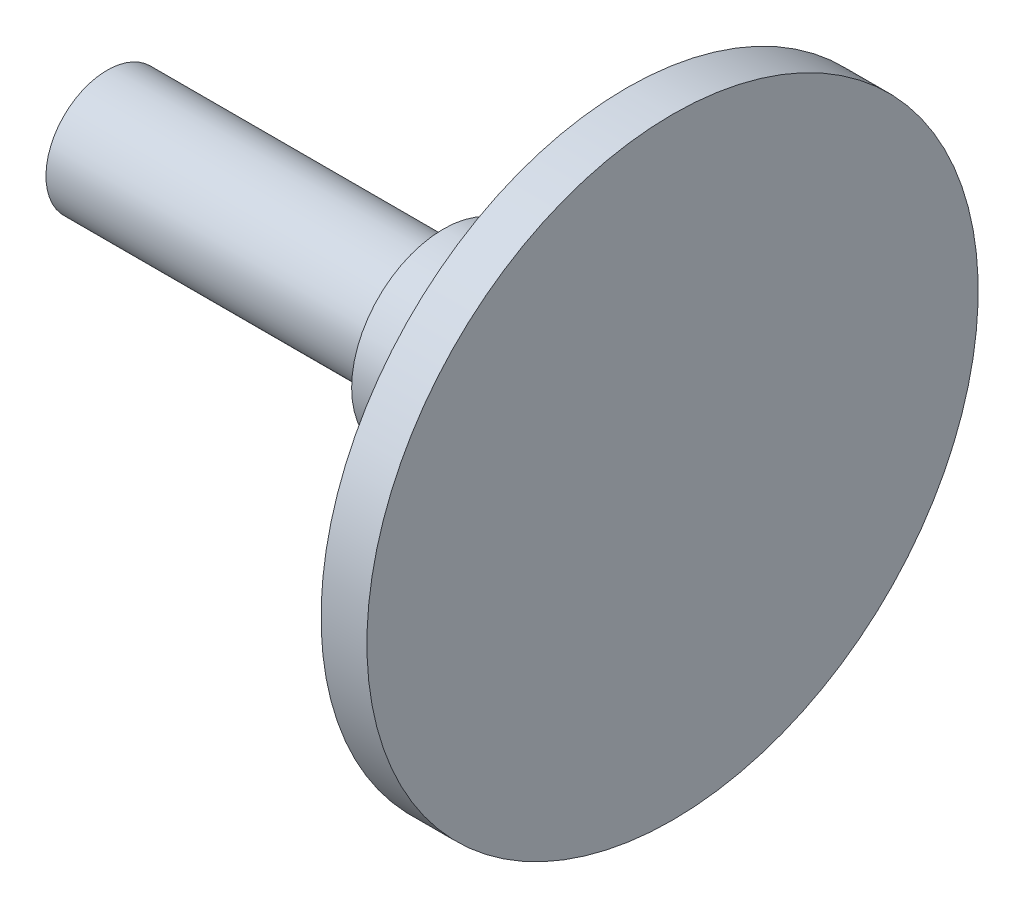
ISO-10303-21;
HEADER;
FILE_DESCRIPTION(('STEP AP214'),'2;1');
FILE_NAME('part.step','',(''),(''),'','','');
FILE_SCHEMA(('AUTOMOTIVE_DESIGN { 1 0 10303 214 1 1 1 1 }'));
ENDSEC;
DATA;
#1=APPLICATION_CONTEXT('core data for automotive mechanical design processes');
#2=APPLICATION_PROTOCOL_DEFINITION('international standard','automotive_design',2000,#1);
#3=PRODUCT_CONTEXT('',#1,'mechanical');
#4=PRODUCT('Part','Part','',(#3));
#5=PRODUCT_RELATED_PRODUCT_CATEGORY('part','',(#4));
#6=PRODUCT_DEFINITION_FORMATION('','',#4);
#7=PRODUCT_DEFINITION_CONTEXT('part definition',#1,'design');
#8=PRODUCT_DEFINITION('design','',#6,#7);
#9=PRODUCT_DEFINITION_SHAPE('','',#8);
#10=(LENGTH_UNIT() NAMED_UNIT(*) SI_UNIT(.MILLI.,.METRE.));
#11=(NAMED_UNIT(*) PLANE_ANGLE_UNIT() SI_UNIT($,.RADIAN.));
#12=(NAMED_UNIT(*) SI_UNIT($,.STERADIAN.) SOLID_ANGLE_UNIT());
#13=UNCERTAINTY_MEASURE_WITH_UNIT(LENGTH_MEASURE(1.E-05),#10,'distance_accuracy_value','');
#14=(GEOMETRIC_REPRESENTATION_CONTEXT(3) GLOBAL_UNCERTAINTY_ASSIGNED_CONTEXT((#13)) GLOBAL_UNIT_ASSIGNED_CONTEXT((#10,
#11,#12)) REPRESENTATION_CONTEXT('',''));
#15=CARTESIAN_POINT('',(0.,0.,0.));
#16=DIRECTION('',(0.,0.,1.));
#17=DIRECTION('',(1.,0.,0.));
#18=AXIS2_PLACEMENT_3D('',#15,#16,#17);
#19=CARTESIAN_POINT('',(-1.5,2.,0.));
#20=DIRECTION('',(1.,0.,0.));
#21=DIRECTION('',(0.,1.,0.));
#22=AXIS2_PLACEMENT_3D('',#19,#20,#21);
#23=PLANE('',#22);
#24=CARTESIAN_POINT('',(-1.5,0.,0.));
#25=DIRECTION('',(-1.,0.,0.));
#26=DIRECTION('',(0.,-1.,0.));
#27=AXIS2_PLACEMENT_3D('',#24,#25,#26);
#28=CIRCLE('',#27,10.);
#29=CARTESIAN_POINT('',(-1.5,-10.,0.));
#30=VERTEX_POINT('',#29);
#31=EDGE_CURVE('E42',#30,#30,#28,.T.);
#32=ORIENTED_EDGE('',*,*,#31,.T.);
#33=EDGE_LOOP('',(#32));
#34=FACE_BOUND('',#33,.T.);
#35=CARTESIAN_POINT('',(-1.5,0.,0.));
#36=DIRECTION('',(1.,0.,0.));
#37=DIRECTION('',(0.,1.,0.));
#38=AXIS2_PLACEMENT_3D('',#35,#36,#37);
#39=CIRCLE('',#38,3.);
#40=CARTESIAN_POINT('',(-1.5,2.99999999999999,0.));
#41=VERTEX_POINT('',#40);
#42=EDGE_CURVE('E10',#41,#41,#39,.F.);
#43=ORIENTED_EDGE('',*,*,#42,.F.);
#44=EDGE_LOOP('',(#43));
#45=FACE_BOUND('',#44,.T.);
#46=ADVANCED_FACE('F30',(#34,#45),#23,.F.);
#47=CARTESIAN_POINT('',(-18.5,0.,0.));
#48=DIRECTION('',(-1.,0.,0.));
#49=DIRECTION('',(0.,-1.,0.));
#50=AXIS2_PLACEMENT_3D('',#47,#48,#49);
#51=CYLINDRICAL_SURFACE('',#50,10.);
#52=ORIENTED_EDGE('',*,*,#31,.F.);
#53=EDGE_LOOP('',(#52));
#54=FACE_BOUND('',#53,.T.);
#55=CARTESIAN_POINT('',(0.,0.,0.));
#56=DIRECTION('',(-1.,0.,0.));
#57=DIRECTION('',(0.,-1.,0.));
#58=AXIS2_PLACEMENT_3D('',#55,#56,#57);
#59=CIRCLE('',#58,10.);
#60=CARTESIAN_POINT('',(0.,-10.,0.));
#61=VERTEX_POINT('',#60);
#62=EDGE_CURVE('E47',#61,#61,#59,.T.);
#63=ORIENTED_EDGE('',*,*,#62,.T.);
#64=EDGE_LOOP('',(#63));
#65=FACE_BOUND('',#64,.T.);
#66=ADVANCED_FACE('F71',(#54,#65),#51,.T.);
#67=CARTESIAN_POINT('',(0.,2.,0.));
#68=DIRECTION('',(-1.,0.,0.));
#69=DIRECTION('',(0.,-1.,0.));
#70=AXIS2_PLACEMENT_3D('',#67,#68,#69);
#71=PLANE('',#70);
#72=ORIENTED_EDGE('',*,*,#62,.F.);
#73=EDGE_LOOP('',(#72));
#74=FACE_BOUND('',#73,.T.);
#75=ADVANCED_FACE('F63',(#74),#71,.F.);
#76=CARTESIAN_POINT('',(-7.5,0.,0.));
#77=DIRECTION('',(-1.,0.,0.));
#78=DIRECTION('',(0.,-1.,0.));
#79=AXIS2_PLACEMENT_3D('',#76,#77,#78);
#80=PLANE('',#79);
#81=CARTESIAN_POINT('',(-7.5,0.,0.));
#82=DIRECTION('',(-1.,0.,0.));
#83=DIRECTION('',(0.,-1.,0.));
#84=AXIS2_PLACEMENT_3D('',#81,#82,#83);
#85=CIRCLE('',#84,3.);
#86=CARTESIAN_POINT('',(-7.5,-3.00000000000001,0.));
#87=VERTEX_POINT('',#86);
#88=EDGE_CURVE('E50',#87,#87,#85,.T.);
#89=ORIENTED_EDGE('',*,*,#88,.T.);
#90=EDGE_LOOP('',(#89));
#91=FACE_BOUND('',#90,.T.);
#92=CARTESIAN_POINT('',(-7.5,0.,0.));
#93=DIRECTION('',(-1.,0.,0.));
#94=DIRECTION('',(0.,-1.,0.));
#95=AXIS2_PLACEMENT_3D('',#92,#93,#94);
#96=CIRCLE('',#95,2.00000000000001);
#97=CARTESIAN_POINT('',(-7.5,-2.00000000000002,0.));
#98=VERTEX_POINT('',#97);
#99=EDGE_CURVE('E34',#98,#98,#96,.T.);
#100=ORIENTED_EDGE('',*,*,#99,.F.);
#101=EDGE_LOOP('',(#100));
#102=FACE_BOUND('',#101,.T.);
#103=ADVANCED_FACE('F60',(#91,#102),#80,.T.);
#104=CARTESIAN_POINT('',(-7.5,0.,0.));
#105=DIRECTION('',(1.,0.,0.));
#106=DIRECTION('',(0.,1.,0.));
#107=AXIS2_PLACEMENT_3D('',#104,#105,#106);
#108=CYLINDRICAL_SURFACE('',#107,3.);
#109=ORIENTED_EDGE('',*,*,#88,.F.);
#110=EDGE_LOOP('',(#109));
#111=FACE_BOUND('',#110,.T.);
#112=ORIENTED_EDGE('',*,*,#42,.T.);
#113=EDGE_LOOP('',(#112));
#114=FACE_BOUND('',#113,.T.);
#115=ADVANCED_FACE('F62',(#111,#114),#108,.T.);
#116=CARTESIAN_POINT('',(-18.5,0.,0.));
#117=DIRECTION('',(1.,0.,0.));
#118=DIRECTION('',(0.,1.,0.));
#119=AXIS2_PLACEMENT_3D('',#116,#117,#118);
#120=PLANE('',#119);
#121=CARTESIAN_POINT('',(-18.5,0.,0.));
#122=DIRECTION('',(-1.,0.,0.));
#123=DIRECTION('',(0.,-1.,0.));
#124=AXIS2_PLACEMENT_3D('',#121,#122,#123);
#125=CIRCLE('',#124,2.00000000000001);
#126=CARTESIAN_POINT('',(-18.5,-2.00000000000002,0.));
#127=VERTEX_POINT('',#126);
#128=EDGE_CURVE('E38',#127,#127,#125,.T.);
#129=ORIENTED_EDGE('',*,*,#128,.T.);
#130=EDGE_LOOP('',(#129));
#131=FACE_BOUND('',#130,.T.);
#132=ADVANCED_FACE('F32',(#131),#120,.F.);
#133=CARTESIAN_POINT('',(-18.5,0.,0.));
#134=DIRECTION('',(-1.,0.,0.));
#135=DIRECTION('',(0.,-1.,0.));
#136=AXIS2_PLACEMENT_3D('',#133,#134,#135);
#137=CYLINDRICAL_SURFACE('',#136,2.00000000000001);
#138=ORIENTED_EDGE('',*,*,#99,.T.);
#139=EDGE_LOOP('',(#138));
#140=FACE_BOUND('',#139,.T.);
#141=ORIENTED_EDGE('',*,*,#128,.F.);
#142=EDGE_LOOP('',(#141));
#143=FACE_BOUND('',#142,.T.);
#144=ADVANCED_FACE('F57',(#140,#143),#137,.T.);
#145=CLOSED_SHELL('',(#46,#66,#75,#103,#115,#132,#144));
#146=MANIFOLD_SOLID_BREP('B2',#145);
#147=ADVANCED_BREP_SHAPE_REPRESENTATION('',(#18,#146),#14);
#148=SHAPE_DEFINITION_REPRESENTATION(#9,#147);
ENDSEC;
END-ISO-10303-21;
